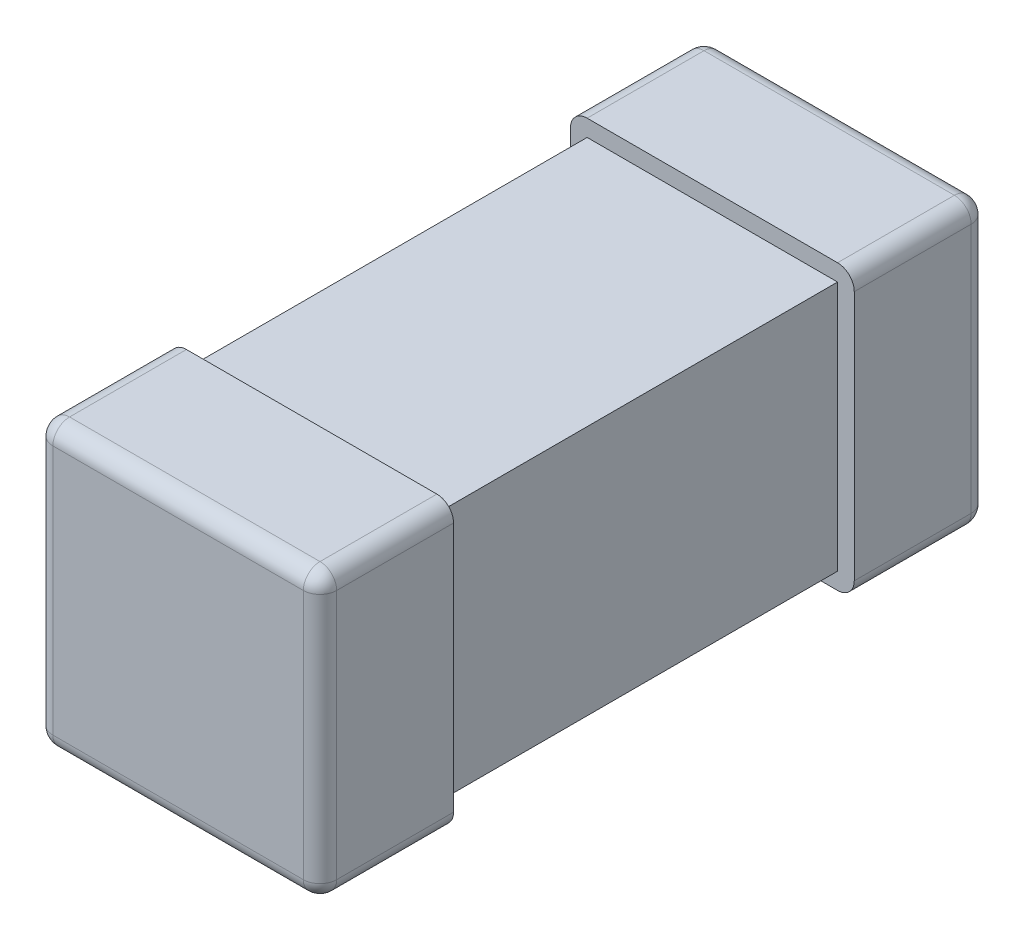
ISO-10303-21;
HEADER;
FILE_DESCRIPTION(('STEP AP214'),'2;1');
FILE_NAME('part.step','',(''),(''),'','','');
FILE_SCHEMA(('AUTOMOTIVE_DESIGN { 1 0 10303 214 1 1 1 1 }'));
ENDSEC;
DATA;
#1=APPLICATION_CONTEXT('core data for automotive mechanical design processes');
#2=APPLICATION_PROTOCOL_DEFINITION('international standard','automotive_design',2000,#1);
#3=PRODUCT_CONTEXT('',#1,'mechanical');
#4=PRODUCT('Part','Part','',(#3));
#5=PRODUCT_RELATED_PRODUCT_CATEGORY('part','',(#4));
#6=PRODUCT_DEFINITION_FORMATION('','',#4);
#7=PRODUCT_DEFINITION_CONTEXT('part definition',#1,'design');
#8=PRODUCT_DEFINITION('design','',#6,#7);
#9=PRODUCT_DEFINITION_SHAPE('','',#8);
#10=(LENGTH_UNIT() NAMED_UNIT(*) SI_UNIT(.MILLI.,.METRE.));
#11=(NAMED_UNIT(*) PLANE_ANGLE_UNIT() SI_UNIT($,.RADIAN.));
#12=(NAMED_UNIT(*) SI_UNIT($,.STERADIAN.) SOLID_ANGLE_UNIT());
#13=UNCERTAINTY_MEASURE_WITH_UNIT(LENGTH_MEASURE(1.E-05),#10,'distance_accuracy_value','');
#14=(GEOMETRIC_REPRESENTATION_CONTEXT(3) GLOBAL_UNCERTAINTY_ASSIGNED_CONTEXT((#13)) GLOBAL_UNIT_ASSIGNED_CONTEXT((#10,
#11,#12)) REPRESENTATION_CONTEXT('',''));
#15=CARTESIAN_POINT('',(0.,0.,0.));
#16=DIRECTION('',(0.,0.,1.));
#17=DIRECTION('',(1.,0.,0.));
#18=AXIS2_PLACEMENT_3D('',#15,#16,#17);
#19=CARTESIAN_POINT('',(-18.9670000000007,2.43166,-7.24620016999998));
#20=DIRECTION('',(0.,0.,-1.));
#21=DIRECTION('',(-1.,0.,0.));
#22=AXIS2_PLACEMENT_3D('',#19,#20,#21);
#23=PLANE('',#22);
#24=DIRECTION('',(0.,1.,0.));
#25=VECTOR('',#24,1.);
#26=CARTESIAN_POINT('',(-18.1670000000007,2.43166,-7.24620016999998));
#27=LINE('',#26,#25);
#28=CARTESIAN_POINT('',(-18.1670000000007,2.38166,-7.24620016999998));
#29=VERTEX_POINT('',#28);
#30=CARTESIAN_POINT('',(-18.1670000000007,1.63166,-7.24620016999998));
#31=VERTEX_POINT('',#30);
#32=EDGE_CURVE('E395',#29,#31,#27,.F.);
#33=ORIENTED_EDGE('',*,*,#32,.F.);
#34=DIRECTION('',(1.,0.,0.));
#35=VECTOR('',#34,1.);
#36=CARTESIAN_POINT('',(-18.9670000000007,2.38166,-7.24620016999998));
#37=LINE('',#36,#35);
#38=CARTESIAN_POINT('',(-18.9170000000007,2.38166,-7.24620016999998));
#39=VERTEX_POINT('',#38);
#40=EDGE_CURVE('E503',#39,#29,#37,.T.);
#41=ORIENTED_EDGE('',*,*,#40,.F.);
#42=DIRECTION('',(0.,-1.,0.));
#43=VECTOR('',#42,1.);
#44=CARTESIAN_POINT('',(-18.9170000000007,1.58166,-7.24620016999998));
#45=LINE('',#44,#43);
#46=CARTESIAN_POINT('',(-18.9170000000007,1.63166,-7.24620016999998));
#47=VERTEX_POINT('',#46);
#48=EDGE_CURVE('E437',#47,#39,#45,.F.);
#49=ORIENTED_EDGE('',*,*,#48,.F.);
#50=DIRECTION('',(1.,0.,0.));
#51=VECTOR('',#50,1.);
#52=CARTESIAN_POINT('',(-18.9670000000007,1.63166,-7.24620016999998));
#53=LINE('',#52,#51);
#54=EDGE_CURVE('E494',#31,#47,#53,.F.);
#55=ORIENTED_EDGE('',*,*,#54,.F.);
#56=EDGE_LOOP('',(#33,#41,#49,#55));
#57=FACE_BOUND('',#56,.T.);
#58=ADVANCED_FACE('F16',(#57),#23,.F.);
#59=CARTESIAN_POINT('',(-18.9670000000007,2.43166,-9.24620016999998));
#60=DIRECTION('',(0.,0.,1.));
#61=DIRECTION('',(1.,0.,0.));
#62=AXIS2_PLACEMENT_3D('',#59,#60,#61);
#63=PLANE('',#62);
#64=DIRECTION('',(0.,1.,0.));
#65=VECTOR('',#64,1.);
#66=CARTESIAN_POINT('',(-18.9170000000007,1.58166,-9.24620016999998));
#67=LINE('',#66,#65);
#68=CARTESIAN_POINT('',(-18.9170000000007,2.38166,-9.24620016999998));
#69=VERTEX_POINT('',#68);
#70=CARTESIAN_POINT('',(-18.9170000000007,1.63166,-9.24620016999998));
#71=VERTEX_POINT('',#70);
#72=EDGE_CURVE('E303',#69,#71,#67,.F.);
#73=ORIENTED_EDGE('',*,*,#72,.F.);
#74=DIRECTION('',(1.,0.,0.));
#75=VECTOR('',#74,1.);
#76=CARTESIAN_POINT('',(-18.9670000000007,2.38166,-9.24620016999998));
#77=LINE('',#76,#75);
#78=CARTESIAN_POINT('',(-18.1670000000007,2.38166,-9.24620016999998));
#79=VERTEX_POINT('',#78);
#80=EDGE_CURVE('E394',#79,#69,#77,.F.);
#81=ORIENTED_EDGE('',*,*,#80,.F.);
#82=DIRECTION('',(0.,-1.,0.));
#83=VECTOR('',#82,1.);
#84=CARTESIAN_POINT('',(-18.1670000000007,2.43166,-9.24620016999998));
#85=LINE('',#84,#83);
#86=CARTESIAN_POINT('',(-18.1670000000007,1.63166,-9.24620016999998));
#87=VERTEX_POINT('',#86);
#88=EDGE_CURVE('E345',#87,#79,#85,.F.);
#89=ORIENTED_EDGE('',*,*,#88,.F.);
#90=DIRECTION('',(1.,0.,0.));
#91=VECTOR('',#90,1.);
#92=CARTESIAN_POINT('',(-18.9670000000007,1.63166,-9.24620016999998));
#93=LINE('',#92,#91);
#94=EDGE_CURVE('E477',#71,#87,#93,.T.);
#95=ORIENTED_EDGE('',*,*,#94,.F.);
#96=EDGE_LOOP('',(#73,#81,#89,#95));
#97=FACE_BOUND('',#96,.T.);
#98=ADVANCED_FACE('F466',(#97),#63,.F.);
#99=CARTESIAN_POINT('',(-18.1670000000007,2.38166,-7.29620016999998));
#100=DIRECTION('',(-1.,0.,0.));
#101=DIRECTION('',(0.,0.,1.));
#102=AXIS2_PLACEMENT_3D('',#99,#100,#101);
#103=SPHERICAL_SURFACE('',#102,0.05);
#104=CARTESIAN_POINT('',(-18.1670000000007,2.38166,-7.29620016999998));
#105=DIRECTION('',(1.,0.,0.));
#106=DIRECTION('',(0.,0.,-1.));
#107=AXIS2_PLACEMENT_3D('',#104,#105,#106);
#108=CIRCLE('',#107,0.05);
#109=CARTESIAN_POINT('',(-18.1670000000007,2.43166,-7.29620016999998));
#110=VERTEX_POINT('',#109);
#111=EDGE_CURVE('E505',#29,#110,#108,.F.);
#112=ORIENTED_EDGE('',*,*,#111,.F.);
#113=CARTESIAN_POINT('',(-18.1670000000007,2.38166,-7.29620016999998));
#114=DIRECTION('',(0.,1.,0.));
#115=DIRECTION('',(-1.,0.,0.));
#116=AXIS2_PLACEMENT_3D('',#113,#114,#115);
#117=CIRCLE('',#116,0.05);
#118=CARTESIAN_POINT('',(-18.1170000000007,2.38166,-7.29620016999998));
#119=VERTEX_POINT('',#118);
#120=EDGE_CURVE('E401',#119,#29,#117,.F.);
#121=ORIENTED_EDGE('',*,*,#120,.F.);
#122=CARTESIAN_POINT('',(-18.1670000000007,2.38166,-7.29620016999998));
#123=DIRECTION('',(0.,0.,-1.));
#124=DIRECTION('',(-1.,0.,0.));
#125=AXIS2_PLACEMENT_3D('',#122,#123,#124);
#126=CIRCLE('',#125,0.05);
#127=EDGE_CURVE('E188',#110,#119,#126,.T.);
#128=ORIENTED_EDGE('',*,*,#127,.F.);
#129=EDGE_LOOP('',(#112,#121,#128));
#130=FACE_BOUND('',#129,.T.);
#131=ADVANCED_FACE('F462',(#130),#103,.T.);
#132=CARTESIAN_POINT('',(-18.9670000000007,2.38166,-7.29620016999998));
#133=DIRECTION('',(1.,0.,0.));
#134=DIRECTION('',(0.,0.,-1.));
#135=AXIS2_PLACEMENT_3D('',#132,#133,#134);
#136=CYLINDRICAL_SURFACE('',#135,0.05);
#137=ORIENTED_EDGE('',*,*,#111,.T.);
#138=DIRECTION('',(1.,0.,0.));
#139=VECTOR('',#138,1.);
#140=CARTESIAN_POINT('',(-18.9670000000007,2.43166,-7.29620016999998));
#141=LINE('',#140,#139);
#142=CARTESIAN_POINT('',(-18.9170000000007,2.43166,-7.29620016999998));
#143=VERTEX_POINT('',#142);
#144=EDGE_CURVE('E186',#110,#143,#141,.F.);
#145=ORIENTED_EDGE('',*,*,#144,.T.);
#146=CARTESIAN_POINT('',(-18.9170000000007,2.38166,-7.29620016999998));
#147=DIRECTION('',(-1.,0.,0.));
#148=DIRECTION('',(0.,0.,1.));
#149=AXIS2_PLACEMENT_3D('',#146,#147,#148);
#150=CIRCLE('',#149,0.0499999999999997);
#151=EDGE_CURVE('E446',#39,#143,#150,.T.);
#152=ORIENTED_EDGE('',*,*,#151,.F.);
#153=ORIENTED_EDGE('',*,*,#40,.T.);
#154=EDGE_LOOP('',(#137,#145,#152,#153));
#155=FACE_BOUND('',#154,.T.);
#156=ADVANCED_FACE('F458',(#155),#136,.T.);
#157=CARTESIAN_POINT('',(-18.9170000000007,2.38166,-7.29620016999998));
#158=DIRECTION('',(-1.,0.,0.));
#159=DIRECTION('',(0.,0.,1.));
#160=AXIS2_PLACEMENT_3D('',#157,#158,#159);
#161=SPHERICAL_SURFACE('',#160,0.05);
#162=CARTESIAN_POINT('',(-18.9170000000007,2.38166,-7.29620016999998));
#163=DIRECTION('',(0.,0.,1.));
#164=DIRECTION('',(1.,0.,0.));
#165=AXIS2_PLACEMENT_3D('',#162,#163,#164);
#166=CIRCLE('',#165,0.05);
#167=CARTESIAN_POINT('',(-18.9670000000007,2.38166,-7.29620016999998));
#168=VERTEX_POINT('',#167);
#169=EDGE_CURVE('E284',#168,#143,#166,.F.);
#170=ORIENTED_EDGE('',*,*,#169,.F.);
#171=CARTESIAN_POINT('',(-18.9170000000007,2.38166,-7.29620016999998));
#172=DIRECTION('',(0.,-1.,0.));
#173=DIRECTION('',(1.,0.,0.));
#174=AXIS2_PLACEMENT_3D('',#171,#172,#173);
#175=CIRCLE('',#174,0.05);
#176=EDGE_CURVE('E444',#39,#168,#175,.T.);
#177=ORIENTED_EDGE('',*,*,#176,.F.);
#178=ORIENTED_EDGE('',*,*,#151,.T.);
#179=EDGE_LOOP('',(#170,#177,#178));
#180=FACE_BOUND('',#179,.T.);
#181=ADVANCED_FACE('F455',(#180),#161,.T.);
#182=CARTESIAN_POINT('',(-18.9170000000007,1.58166,-7.29620016999998));
#183=DIRECTION('',(0.,-1.,0.));
#184=DIRECTION('',(1.,0.,0.));
#185=AXIS2_PLACEMENT_3D('',#182,#183,#184);
#186=CYLINDRICAL_SURFACE('',#185,0.05);
#187=CARTESIAN_POINT('',(-18.9170000000007,1.63166,-7.29620016999998));
#188=DIRECTION('',(0.,1.,0.));
#189=DIRECTION('',(-1.,0.,0.));
#190=AXIS2_PLACEMENT_3D('',#187,#188,#189);
#191=CIRCLE('',#190,0.05);
#192=CARTESIAN_POINT('',(-18.9670000000007,1.63166,-7.29620016999998));
#193=VERTEX_POINT('',#192);
#194=EDGE_CURVE('E434',#47,#193,#191,.F.);
#195=ORIENTED_EDGE('',*,*,#194,.F.);
#196=ORIENTED_EDGE('',*,*,#48,.T.);
#197=ORIENTED_EDGE('',*,*,#176,.T.);
#198=DIRECTION('',(0.,1.,0.));
#199=VECTOR('',#198,1.);
#200=CARTESIAN_POINT('',(-18.9670000000007,1.58166,-7.29620016999998));
#201=LINE('',#200,#199);
#202=EDGE_CURVE('E279',#193,#168,#201,.T.);
#203=ORIENTED_EDGE('',*,*,#202,.F.);
#204=EDGE_LOOP('',(#195,#196,#197,#203));
#205=FACE_BOUND('',#204,.T.);
#206=ADVANCED_FACE('F426',(#205),#186,.T.);
#207=CARTESIAN_POINT('',(-18.9170000000007,1.63166,-7.29620016999998));
#208=DIRECTION('',(-1.,0.,0.));
#209=DIRECTION('',(0.,0.,1.));
#210=AXIS2_PLACEMENT_3D('',#207,#208,#209);
#211=SPHERICAL_SURFACE('',#210,0.05);
#212=CARTESIAN_POINT('',(-18.9170000000007,1.63166,-7.29620016999998));
#213=DIRECTION('',(0.,0.,-1.));
#214=DIRECTION('',(-1.,0.,0.));
#215=AXIS2_PLACEMENT_3D('',#212,#213,#214);
#216=CIRCLE('',#215,0.05);
#217=CARTESIAN_POINT('',(-18.9170000000007,1.58166,-7.29620016999998));
#218=VERTEX_POINT('',#217);
#219=EDGE_CURVE('E274',#218,#193,#216,.T.);
#220=ORIENTED_EDGE('',*,*,#219,.F.);
#221=CARTESIAN_POINT('',(-18.9170000000007,1.63166,-7.29620016999998));
#222=DIRECTION('',(1.,0.,0.));
#223=DIRECTION('',(0.,0.,-1.));
#224=AXIS2_PLACEMENT_3D('',#221,#222,#223);
#225=CIRCLE('',#224,0.05);
#226=EDGE_CURVE('E436',#47,#218,#225,.T.);
#227=ORIENTED_EDGE('',*,*,#226,.F.);
#228=ORIENTED_EDGE('',*,*,#194,.T.);
#229=EDGE_LOOP('',(#220,#227,#228));
#230=FACE_BOUND('',#229,.T.);
#231=ADVANCED_FACE('F421',(#230),#211,.T.);
#232=CARTESIAN_POINT('',(-18.9670000000007,1.63166,-7.29620016999998));
#233=DIRECTION('',(1.,0.,0.));
#234=DIRECTION('',(0.,0.,-1.));
#235=AXIS2_PLACEMENT_3D('',#232,#233,#234);
#236=CYLINDRICAL_SURFACE('',#235,0.05);
#237=CARTESIAN_POINT('',(-18.1670000000007,1.63166,-7.29620016999998));
#238=DIRECTION('',(-1.,0.,0.));
#239=DIRECTION('',(0.,0.,1.));
#240=AXIS2_PLACEMENT_3D('',#237,#238,#239);
#241=CIRCLE('',#240,0.0499999999999997);
#242=CARTESIAN_POINT('',(-18.1670000000007,1.58166,-7.29620016999998));
#243=VERTEX_POINT('',#242);
#244=EDGE_CURVE('E404',#31,#243,#241,.F.);
#245=ORIENTED_EDGE('',*,*,#244,.F.);
#246=ORIENTED_EDGE('',*,*,#54,.T.);
#247=ORIENTED_EDGE('',*,*,#226,.T.);
#248=DIRECTION('',(-1.,0.,0.));
#249=VECTOR('',#248,1.);
#250=CARTESIAN_POINT('',(-18.9670000000007,1.58166,-7.29620016999998));
#251=LINE('',#250,#249);
#252=EDGE_CURVE('E269',#218,#243,#251,.F.);
#253=ORIENTED_EDGE('',*,*,#252,.T.);
#254=EDGE_LOOP('',(#245,#246,#247,#253));
#255=FACE_BOUND('',#254,.T.);
#256=ADVANCED_FACE('F417',(#255),#236,.T.);
#257=CARTESIAN_POINT('',(-18.1670000000007,1.63166,-7.29620016999998));
#258=DIRECTION('',(-1.,0.,0.));
#259=DIRECTION('',(0.,0.,1.));
#260=AXIS2_PLACEMENT_3D('',#257,#258,#259);
#261=SPHERICAL_SURFACE('',#260,0.05);
#262=ORIENTED_EDGE('',*,*,#244,.T.);
#263=CARTESIAN_POINT('',(-18.1670000000007,1.63166,-7.29620016999998));
#264=DIRECTION('',(0.,0.,1.));
#265=DIRECTION('',(1.,0.,0.));
#266=AXIS2_PLACEMENT_3D('',#263,#264,#265);
#267=CIRCLE('',#266,0.05);
#268=CARTESIAN_POINT('',(-18.1170000000007,1.63166,-7.29620016999998));
#269=VERTEX_POINT('',#268);
#270=EDGE_CURVE('E263',#269,#243,#267,.F.);
#271=ORIENTED_EDGE('',*,*,#270,.F.);
#272=CARTESIAN_POINT('',(-18.1670000000007,1.63166,-7.29620016999998));
#273=DIRECTION('',(0.,1.,0.));
#274=DIRECTION('',(-1.,0.,0.));
#275=AXIS2_PLACEMENT_3D('',#272,#273,#274);
#276=CIRCLE('',#275,0.05);
#277=EDGE_CURVE('E392',#31,#269,#276,.T.);
#278=ORIENTED_EDGE('',*,*,#277,.F.);
#279=EDGE_LOOP('',(#262,#271,#278));
#280=FACE_BOUND('',#279,.T.);
#281=ADVANCED_FACE('F414',(#280),#261,.T.);
#282=CARTESIAN_POINT('',(-18.1670000000007,2.43166,-7.29620016999998));
#283=DIRECTION('',(0.,1.,0.));
#284=DIRECTION('',(-1.,0.,0.));
#285=AXIS2_PLACEMENT_3D('',#282,#283,#284);
#286=CYLINDRICAL_SURFACE('',#285,0.05);
#287=ORIENTED_EDGE('',*,*,#277,.T.);
#288=DIRECTION('',(0.,1.,0.));
#289=VECTOR('',#288,1.);
#290=CARTESIAN_POINT('',(-18.1170000000007,1.58166,-7.29620016999998));
#291=LINE('',#290,#289);
#292=EDGE_CURVE('E255',#269,#119,#291,.T.);
#293=ORIENTED_EDGE('',*,*,#292,.T.);
#294=ORIENTED_EDGE('',*,*,#120,.T.);
#295=ORIENTED_EDGE('',*,*,#32,.T.);
#296=EDGE_LOOP('',(#287,#293,#294,#295));
#297=FACE_BOUND('',#296,.T.);
#298=ADVANCED_FACE('F376',(#297),#286,.T.);
#299=CARTESIAN_POINT('',(-18.9170000000007,2.38166,-9.19620016999998));
#300=DIRECTION('',(-1.,0.,0.));
#301=DIRECTION('',(0.,0.,1.));
#302=AXIS2_PLACEMENT_3D('',#299,#300,#301);
#303=SPHERICAL_SURFACE('',#302,0.05);
#304=CARTESIAN_POINT('',(-18.9170000000007,2.38166,-9.19620016999998));
#305=DIRECTION('',(1.,0.,0.));
#306=DIRECTION('',(0.,0.,-1.));
#307=AXIS2_PLACEMENT_3D('',#304,#305,#306);
#308=CIRCLE('',#307,0.05);
#309=CARTESIAN_POINT('',(-18.9170000000007,2.43166,-9.19620016999998));
#310=VERTEX_POINT('',#309);
#311=EDGE_CURVE('E487',#69,#310,#308,.T.);
#312=ORIENTED_EDGE('',*,*,#311,.F.);
#313=CARTESIAN_POINT('',(-18.9170000000007,2.38166,-9.19620016999998));
#314=DIRECTION('',(0.,1.,0.));
#315=DIRECTION('',(-1.,0.,0.));
#316=AXIS2_PLACEMENT_3D('',#313,#314,#315);
#317=CIRCLE('',#316,0.05);
#318=CARTESIAN_POINT('',(-18.9670000000007,2.38166,-9.19620016999998));
#319=VERTEX_POINT('',#318);
#320=EDGE_CURVE('E300',#319,#69,#317,.F.);
#321=ORIENTED_EDGE('',*,*,#320,.F.);
#322=CARTESIAN_POINT('',(-18.9170000000007,2.38166,-9.19620016999998));
#323=DIRECTION('',(0.,0.,1.));
#324=DIRECTION('',(1.,0.,0.));
#325=AXIS2_PLACEMENT_3D('',#322,#323,#324);
#326=CIRCLE('',#325,0.05);
#327=EDGE_CURVE('E249',#310,#319,#326,.T.);
#328=ORIENTED_EDGE('',*,*,#327,.F.);
#329=EDGE_LOOP('',(#312,#321,#328));
#330=FACE_BOUND('',#329,.T.);
#331=ADVANCED_FACE('F371',(#330),#303,.T.);
#332=CARTESIAN_POINT('',(-18.9670000000007,2.38166,-9.19620016999998));
#333=DIRECTION('',(1.,0.,0.));
#334=DIRECTION('',(0.,0.,-1.));
#335=AXIS2_PLACEMENT_3D('',#332,#333,#334);
#336=CYLINDRICAL_SURFACE('',#335,0.05);
#337=ORIENTED_EDGE('',*,*,#311,.T.);
#338=DIRECTION('',(1.,0.,0.));
#339=VECTOR('',#338,1.);
#340=CARTESIAN_POINT('',(-18.9670000000007,2.43166,-9.19620016999998));
#341=LINE('',#340,#339);
#342=CARTESIAN_POINT('',(-18.1670000000007,2.43166,-9.19620016999998));
#343=VERTEX_POINT('',#342);
#344=EDGE_CURVE('E248',#310,#343,#341,.T.);
#345=ORIENTED_EDGE('',*,*,#344,.T.);
#346=CARTESIAN_POINT('',(-18.1670000000007,2.38166,-9.19620016999998));
#347=DIRECTION('',(-1.,0.,0.));
#348=DIRECTION('',(0.,0.,1.));
#349=AXIS2_PLACEMENT_3D('',#346,#347,#348);
#350=CIRCLE('',#349,0.0499999999999997);
#351=EDGE_CURVE('E350',#79,#343,#350,.F.);
#352=ORIENTED_EDGE('',*,*,#351,.F.);
#353=ORIENTED_EDGE('',*,*,#80,.T.);
#354=EDGE_LOOP('',(#337,#345,#352,#353));
#355=FACE_BOUND('',#354,.T.);
#356=ADVANCED_FACE('F367',(#355),#336,.T.);
#357=CARTESIAN_POINT('',(-18.1670000000007,2.38166,-9.19620016999998));
#358=DIRECTION('',(-1.,0.,0.));
#359=DIRECTION('',(0.,0.,1.));
#360=AXIS2_PLACEMENT_3D('',#357,#358,#359);
#361=SPHERICAL_SURFACE('',#360,0.05);
#362=CARTESIAN_POINT('',(-18.1670000000007,2.38166,-9.19620016999998));
#363=DIRECTION('',(0.,-1.,0.));
#364=DIRECTION('',(1.,0.,0.));
#365=AXIS2_PLACEMENT_3D('',#362,#363,#364);
#366=CIRCLE('',#365,0.05);
#367=CARTESIAN_POINT('',(-18.1170000000007,2.38166,-9.19620016999998));
#368=VERTEX_POINT('',#367);
#369=EDGE_CURVE('E348',#79,#368,#366,.T.);
#370=ORIENTED_EDGE('',*,*,#369,.F.);
#371=ORIENTED_EDGE('',*,*,#351,.T.);
#372=CARTESIAN_POINT('',(-18.1670000000007,2.38166,-9.19620016999998));
#373=DIRECTION('',(0.,0.,-1.));
#374=DIRECTION('',(-1.,0.,0.));
#375=AXIS2_PLACEMENT_3D('',#372,#373,#374);
#376=CIRCLE('',#375,0.05);
#377=EDGE_CURVE('E242',#368,#343,#376,.F.);
#378=ORIENTED_EDGE('',*,*,#377,.F.);
#379=EDGE_LOOP('',(#370,#371,#378));
#380=FACE_BOUND('',#379,.T.);
#381=ADVANCED_FACE('F364',(#380),#361,.T.);
#382=CARTESIAN_POINT('',(-18.1670000000007,2.43166,-9.19620016999998));
#383=DIRECTION('',(0.,-1.,0.));
#384=DIRECTION('',(1.,0.,0.));
#385=AXIS2_PLACEMENT_3D('',#382,#383,#384);
#386=CYLINDRICAL_SURFACE('',#385,0.05);
#387=CARTESIAN_POINT('',(-18.1670000000007,1.63166,-9.19620016999998));
#388=DIRECTION('',(0.,-1.,0.));
#389=DIRECTION('',(-1.,0.,0.));
#390=AXIS2_PLACEMENT_3D('',#387,#388,#389);
#391=CIRCLE('',#390,0.05);
#392=CARTESIAN_POINT('',(-18.1170000000007,1.63166,-9.19620016999998));
#393=VERTEX_POINT('',#392);
#394=EDGE_CURVE('E342',#87,#393,#391,.T.);
#395=ORIENTED_EDGE('',*,*,#394,.F.);
#396=ORIENTED_EDGE('',*,*,#88,.T.);
#397=ORIENTED_EDGE('',*,*,#369,.T.);
#398=DIRECTION('',(0.,1.,0.));
#399=VECTOR('',#398,1.);
#400=CARTESIAN_POINT('',(-18.1170000000007,1.58166,-9.19620016999998));
#401=LINE('',#400,#399);
#402=EDGE_CURVE('E237',#368,#393,#401,.F.);
#403=ORIENTED_EDGE('',*,*,#402,.T.);
#404=EDGE_LOOP('',(#395,#396,#397,#403));
#405=FACE_BOUND('',#404,.T.);
#406=ADVANCED_FACE('F334',(#405),#386,.T.);
#407=CARTESIAN_POINT('',(-18.1670000000007,1.63166,-9.19620016999998));
#408=DIRECTION('',(-1.,0.,0.));
#409=DIRECTION('',(0.,0.,1.));
#410=AXIS2_PLACEMENT_3D('',#407,#408,#409);
#411=SPHERICAL_SURFACE('',#410,0.05);
#412=CARTESIAN_POINT('',(-18.1670000000007,1.63166,-9.19620016999998));
#413=DIRECTION('',(0.,0.,1.));
#414=DIRECTION('',(1.,0.,0.));
#415=AXIS2_PLACEMENT_3D('',#412,#413,#414);
#416=CIRCLE('',#415,0.05);
#417=CARTESIAN_POINT('',(-18.1670000000007,1.58166,-9.19620016999998));
#418=VERTEX_POINT('',#417);
#419=EDGE_CURVE('E231',#418,#393,#416,.T.);
#420=ORIENTED_EDGE('',*,*,#419,.F.);
#421=CARTESIAN_POINT('',(-18.1670000000007,1.63166,-9.19620016999998));
#422=DIRECTION('',(1.,0.,0.));
#423=DIRECTION('',(0.,0.,-1.));
#424=AXIS2_PLACEMENT_3D('',#421,#422,#423);
#425=CIRCLE('',#424,0.05);
#426=EDGE_CURVE('E344',#87,#418,#425,.F.);
#427=ORIENTED_EDGE('',*,*,#426,.F.);
#428=ORIENTED_EDGE('',*,*,#394,.T.);
#429=EDGE_LOOP('',(#420,#427,#428));
#430=FACE_BOUND('',#429,.T.);
#431=ADVANCED_FACE('F329',(#430),#411,.T.);
#432=CARTESIAN_POINT('',(-18.9670000000007,1.63166,-9.19620016999998));
#433=DIRECTION('',(1.,0.,0.));
#434=DIRECTION('',(0.,0.,-1.));
#435=AXIS2_PLACEMENT_3D('',#432,#433,#434);
#436=CYLINDRICAL_SURFACE('',#435,0.05);
#437=CARTESIAN_POINT('',(-18.9170000000007,1.63166,-9.19620016999998));
#438=DIRECTION('',(-1.,0.,0.));
#439=DIRECTION('',(0.,0.,1.));
#440=AXIS2_PLACEMENT_3D('',#437,#438,#439);
#441=CIRCLE('',#440,0.0499999999999997);
#442=CARTESIAN_POINT('',(-18.9170000000007,1.58166,-9.19620016999998));
#443=VERTEX_POINT('',#442);
#444=EDGE_CURVE('E304',#71,#443,#441,.T.);
#445=ORIENTED_EDGE('',*,*,#444,.F.);
#446=ORIENTED_EDGE('',*,*,#94,.T.);
#447=ORIENTED_EDGE('',*,*,#426,.T.);
#448=DIRECTION('',(-1.,0.,0.));
#449=VECTOR('',#448,1.);
#450=CARTESIAN_POINT('',(-18.9670000000007,1.58166,-9.19620016999998));
#451=LINE('',#450,#449);
#452=EDGE_CURVE('E226',#418,#443,#451,.T.);
#453=ORIENTED_EDGE('',*,*,#452,.T.);
#454=EDGE_LOOP('',(#445,#446,#447,#453));
#455=FACE_BOUND('',#454,.T.);
#456=ADVANCED_FACE('F324',(#455),#436,.T.);
#457=CARTESIAN_POINT('',(-18.9170000000007,1.63166,-9.19620016999998));
#458=DIRECTION('',(-1.,0.,0.));
#459=DIRECTION('',(0.,0.,1.));
#460=AXIS2_PLACEMENT_3D('',#457,#458,#459);
#461=SPHERICAL_SURFACE('',#460,0.05);
#462=CARTESIAN_POINT('',(-18.9170000000007,1.63166,-9.19620016999998));
#463=DIRECTION('',(0.,0.,-1.));
#464=DIRECTION('',(-1.,0.,0.));
#465=AXIS2_PLACEMENT_3D('',#462,#463,#464);
#466=CIRCLE('',#465,0.05);
#467=CARTESIAN_POINT('',(-18.9670000000007,1.63166,-9.19620016999998));
#468=VERTEX_POINT('',#467);
#469=EDGE_CURVE('E220',#468,#443,#466,.F.);
#470=ORIENTED_EDGE('',*,*,#469,.F.);
#471=CARTESIAN_POINT('',(-18.9170000000007,1.63166,-9.19620016999998));
#472=DIRECTION('',(0.,1.,0.));
#473=DIRECTION('',(-1.,0.,0.));
#474=AXIS2_PLACEMENT_3D('',#471,#472,#473);
#475=CIRCLE('',#474,0.05);
#476=EDGE_CURVE('E307',#71,#468,#475,.T.);
#477=ORIENTED_EDGE('',*,*,#476,.F.);
#478=ORIENTED_EDGE('',*,*,#444,.T.);
#479=EDGE_LOOP('',(#470,#477,#478));
#480=FACE_BOUND('',#479,.T.);
#481=ADVANCED_FACE('F319',(#480),#461,.T.);
#482=CARTESIAN_POINT('',(-18.9170000000007,1.58166,-9.19620016999998));
#483=DIRECTION('',(0.,1.,0.));
#484=DIRECTION('',(-1.,0.,0.));
#485=AXIS2_PLACEMENT_3D('',#482,#483,#484);
#486=CYLINDRICAL_SURFACE('',#485,0.05);
#487=ORIENTED_EDGE('',*,*,#476,.T.);
#488=DIRECTION('',(0.,1.,0.));
#489=VECTOR('',#488,1.);
#490=CARTESIAN_POINT('',(-18.9670000000007,1.58166,-9.19620016999998));
#491=LINE('',#490,#489);
#492=EDGE_CURVE('E213',#319,#468,#491,.F.);
#493=ORIENTED_EDGE('',*,*,#492,.F.);
#494=ORIENTED_EDGE('',*,*,#320,.T.);
#495=ORIENTED_EDGE('',*,*,#72,.T.);
#496=EDGE_LOOP('',(#487,#493,#494,#495));
#497=FACE_BOUND('',#496,.T.);
#498=ADVANCED_FACE('F323',(#497),#486,.T.);
#499=CARTESIAN_POINT('',(-18.1670000000007,2.38166,-7.64620016999998));
#500=DIRECTION('',(0.,0.,-1.));
#501=DIRECTION('',(-1.,0.,0.));
#502=AXIS2_PLACEMENT_3D('',#499,#500,#501);
#503=CYLINDRICAL_SURFACE('',#502,0.05);
#504=ORIENTED_EDGE('',*,*,#127,.T.);
#505=DIRECTION('',(0.,0.,1.));
#506=VECTOR('',#505,1.);
#507=CARTESIAN_POINT('',(-18.1170000000007,2.38166,-7.64620016999998));
#508=LINE('',#507,#506);
#509=CARTESIAN_POINT('',(-18.1170000000007,2.38166,-7.64620016999998));
#510=VERTEX_POINT('',#509);
#511=EDGE_CURVE('E199',#119,#510,#508,.F.);
#512=ORIENTED_EDGE('',*,*,#511,.T.);
#513=CARTESIAN_POINT('',(-18.1670000000007,2.38166,-7.64620016999998));
#514=DIRECTION('',(0.,0.,-1.));
#515=DIRECTION('',(-1.,0.,0.));
#516=AXIS2_PLACEMENT_3D('',#513,#514,#515);
#517=CIRCLE('',#516,0.05);
#518=CARTESIAN_POINT('',(-18.1670000000007,2.43166,-7.64620016999998));
#519=VERTEX_POINT('',#518);
#520=EDGE_CURVE('E19',#510,#519,#517,.F.);
#521=ORIENTED_EDGE('',*,*,#520,.T.);
#522=DIRECTION('',(0.,0.,1.));
#523=VECTOR('',#522,1.);
#524=CARTESIAN_POINT('',(-18.1670000000007,2.43166,-7.64620016999998));
#525=LINE('',#524,#523);
#526=EDGE_CURVE('E181',#519,#110,#525,.T.);
#527=ORIENTED_EDGE('',*,*,#526,.T.);
#528=EDGE_LOOP('',(#504,#512,#521,#527));
#529=FACE_BOUND('',#528,.T.);
#530=ADVANCED_FACE('F197',(#529),#503,.T.);
#531=CARTESIAN_POINT('',(-18.9670000000007,2.43166,-7.64620016999998));
#532=DIRECTION('',(0.,-1.,0.));
#533=DIRECTION('',(1.,0.,0.));
#534=AXIS2_PLACEMENT_3D('',#531,#532,#533);
#535=PLANE('',#534);
#536=ORIENTED_EDGE('',*,*,#526,.F.);
#537=DIRECTION('',(1.,0.,0.));
#538=VECTOR('',#537,1.);
#539=CARTESIAN_POINT('',(-18.9670000000007,2.43166,-7.64620016999998));
#540=LINE('',#539,#538);
#541=CARTESIAN_POINT('',(-18.9170000000007,2.43166,-7.64620016999998));
#542=VERTEX_POINT('',#541);
#543=EDGE_CURVE('E184',#519,#542,#540,.F.);
#544=ORIENTED_EDGE('',*,*,#543,.T.);
#545=DIRECTION('',(0.,0.,1.));
#546=VECTOR('',#545,1.);
#547=CARTESIAN_POINT('',(-18.9170000000007,2.43166,-7.64620016999998));
#548=LINE('',#547,#546);
#549=EDGE_CURVE('E282',#143,#542,#548,.F.);
#550=ORIENTED_EDGE('',*,*,#549,.F.);
#551=ORIENTED_EDGE('',*,*,#144,.F.);
#552=EDGE_LOOP('',(#536,#544,#550,#551));
#553=FACE_BOUND('',#552,.T.);
#554=ADVANCED_FACE('F182',(#553),#535,.F.);
#555=CARTESIAN_POINT('',(-18.9170000000007,2.38166,-7.64620016999998));
#556=DIRECTION('',(0.,0.,1.));
#557=DIRECTION('',(1.,0.,0.));
#558=AXIS2_PLACEMENT_3D('',#555,#556,#557);
#559=CYLINDRICAL_SURFACE('',#558,0.05);
#560=CARTESIAN_POINT('',(-18.9170000000007,2.38166,-7.64620016999998));
#561=DIRECTION('',(0.,0.,1.));
#562=DIRECTION('',(1.,0.,0.));
#563=AXIS2_PLACEMENT_3D('',#560,#561,#562);
#564=CIRCLE('',#563,0.05);
#565=CARTESIAN_POINT('',(-18.9670000000007,2.38166,-7.64620016999998));
#566=VERTEX_POINT('',#565);
#567=EDGE_CURVE('E195',#542,#566,#564,.T.);
#568=ORIENTED_EDGE('',*,*,#567,.T.);
#569=DIRECTION('',(0.,0.,1.));
#570=VECTOR('',#569,1.);
#571=CARTESIAN_POINT('',(-18.9670000000007,2.38166,-7.64620016999998));
#572=LINE('',#571,#570);
#573=EDGE_CURVE('E277',#168,#566,#572,.F.);
#574=ORIENTED_EDGE('',*,*,#573,.F.);
#575=ORIENTED_EDGE('',*,*,#169,.T.);
#576=ORIENTED_EDGE('',*,*,#549,.T.);
#577=EDGE_LOOP('',(#568,#574,#575,#576));
#578=FACE_BOUND('',#577,.T.);
#579=ADVANCED_FACE('F700',(#578),#559,.T.);
#580=CARTESIAN_POINT('',(-18.9670000000007,1.58166,-7.64620016999998));
#581=DIRECTION('',(-1.,0.,0.));
#582=DIRECTION('',(0.,0.,1.));
#583=AXIS2_PLACEMENT_3D('',#580,#581,#582);
#584=PLANE('',#583);
#585=ORIENTED_EDGE('',*,*,#202,.T.);
#586=ORIENTED_EDGE('',*,*,#573,.T.);
#587=DIRECTION('',(0.,1.,0.));
#588=VECTOR('',#587,1.);
#589=CARTESIAN_POINT('',(-18.9670000000007,2.43166,-7.64620016999998));
#590=LINE('',#589,#588);
#591=CARTESIAN_POINT('',(-18.9670000000007,1.63166,-7.64620016999998));
#592=VERTEX_POINT('',#591);
#593=EDGE_CURVE('E532',#566,#592,#590,.F.);
#594=ORIENTED_EDGE('',*,*,#593,.T.);
#595=DIRECTION('',(0.,0.,-1.));
#596=VECTOR('',#595,1.);
#597=CARTESIAN_POINT('',(-18.9670000000007,1.63166,-7.64620016999998));
#598=LINE('',#597,#596);
#599=EDGE_CURVE('E270',#193,#592,#598,.T.);
#600=ORIENTED_EDGE('',*,*,#599,.F.);
#601=EDGE_LOOP('',(#585,#586,#594,#600));
#602=FACE_BOUND('',#601,.T.);
#603=ADVANCED_FACE('F696',(#602),#584,.T.);
#604=CARTESIAN_POINT('',(-18.9170000000007,1.63166,-7.64620016999998));
#605=DIRECTION('',(0.,0.,-1.));
#606=DIRECTION('',(-1.,0.,0.));
#607=AXIS2_PLACEMENT_3D('',#604,#605,#606);
#608=CYLINDRICAL_SURFACE('',#607,0.05);
#609=ORIENTED_EDGE('',*,*,#219,.T.);
#610=ORIENTED_EDGE('',*,*,#599,.T.);
#611=CARTESIAN_POINT('',(-18.9170000000007,1.63166,-7.64620016999998));
#612=DIRECTION('',(0.,0.,-1.));
#613=DIRECTION('',(-1.,0.,0.));
#614=AXIS2_PLACEMENT_3D('',#611,#612,#613);
#615=CIRCLE('',#614,0.05);
#616=CARTESIAN_POINT('',(-18.9170000000007,1.58166,-7.64620016999998));
#617=VERTEX_POINT('',#616);
#618=EDGE_CURVE('E530',#592,#617,#615,.F.);
#619=ORIENTED_EDGE('',*,*,#618,.T.);
#620=DIRECTION('',(0.,0.,1.));
#621=VECTOR('',#620,1.);
#622=CARTESIAN_POINT('',(-18.9170000000007,1.58166,-7.64620016999998));
#623=LINE('',#622,#621);
#624=EDGE_CURVE('E266',#617,#218,#623,.T.);
#625=ORIENTED_EDGE('',*,*,#624,.T.);
#626=EDGE_LOOP('',(#609,#610,#619,#625));
#627=FACE_BOUND('',#626,.T.);
#628=ADVANCED_FACE('F692',(#627),#608,.T.);
#629=CARTESIAN_POINT('',(-18.9670000000007,1.58166,-7.64620016999998));
#630=DIRECTION('',(0.,1.,0.));
#631=DIRECTION('',(-1.,0.,0.));
#632=AXIS2_PLACEMENT_3D('',#629,#630,#631);
#633=PLANE('',#632);
#634=DIRECTION('',(0.,0.,1.));
#635=VECTOR('',#634,1.);
#636=CARTESIAN_POINT('',(-18.1670000000007,1.58166,-7.64620016999998));
#637=LINE('',#636,#635);
#638=CARTESIAN_POINT('',(-18.1670000000007,1.58166,-7.64620016999998));
#639=VERTEX_POINT('',#638);
#640=EDGE_CURVE('E259',#243,#639,#637,.F.);
#641=ORIENTED_EDGE('',*,*,#640,.F.);
#642=ORIENTED_EDGE('',*,*,#252,.F.);
#643=ORIENTED_EDGE('',*,*,#624,.F.);
#644=DIRECTION('',(1.,0.,0.));
#645=VECTOR('',#644,1.);
#646=CARTESIAN_POINT('',(-18.9670000000007,1.58166,-7.64620016999998));
#647=LINE('',#646,#645);
#648=EDGE_CURVE('E529',#617,#639,#647,.T.);
#649=ORIENTED_EDGE('',*,*,#648,.T.);
#650=EDGE_LOOP('',(#641,#642,#643,#649));
#651=FACE_BOUND('',#650,.T.);
#652=ADVANCED_FACE('F688',(#651),#633,.F.);
#653=CARTESIAN_POINT('',(-18.1670000000007,1.63166,-7.64620016999998));
#654=DIRECTION('',(0.,0.,1.));
#655=DIRECTION('',(1.,0.,0.));
#656=AXIS2_PLACEMENT_3D('',#653,#654,#655);
#657=CYLINDRICAL_SURFACE('',#656,0.05);
#658=ORIENTED_EDGE('',*,*,#270,.T.);
#659=ORIENTED_EDGE('',*,*,#640,.T.);
#660=CARTESIAN_POINT('',(-18.1670000000007,1.63166,-7.64620016999998));
#661=DIRECTION('',(0.,0.,1.));
#662=DIRECTION('',(1.,0.,0.));
#663=AXIS2_PLACEMENT_3D('',#660,#661,#662);
#664=CIRCLE('',#663,0.05);
#665=CARTESIAN_POINT('',(-18.1170000000007,1.63166,-7.64620016999998));
#666=VERTEX_POINT('',#665);
#667=EDGE_CURVE('E525',#639,#666,#664,.T.);
#668=ORIENTED_EDGE('',*,*,#667,.T.);
#669=DIRECTION('',(0.,0.,1.));
#670=VECTOR('',#669,1.);
#671=CARTESIAN_POINT('',(-18.1170000000007,1.63166,-7.64620016999998));
#672=LINE('',#671,#670);
#673=EDGE_CURVE('E252',#666,#269,#672,.T.);
#674=ORIENTED_EDGE('',*,*,#673,.T.);
#675=EDGE_LOOP('',(#658,#659,#668,#674));
#676=FACE_BOUND('',#675,.T.);
#677=ADVANCED_FACE('F684',(#676),#657,.T.);
#678=CARTESIAN_POINT('',(-18.1170000000007,1.58166,-7.64620016999998));
#679=DIRECTION('',(-1.,0.,0.));
#680=DIRECTION('',(0.,0.,1.));
#681=AXIS2_PLACEMENT_3D('',#678,#679,#680);
#682=PLANE('',#681);
#683=ORIENTED_EDGE('',*,*,#673,.F.);
#684=DIRECTION('',(0.,1.,0.));
#685=VECTOR('',#684,1.);
#686=CARTESIAN_POINT('',(-18.1170000000007,2.43166,-7.64620016999998));
#687=LINE('',#686,#685);
#688=EDGE_CURVE('E528',#666,#510,#687,.T.);
#689=ORIENTED_EDGE('',*,*,#688,.T.);
#690=ORIENTED_EDGE('',*,*,#511,.F.);
#691=ORIENTED_EDGE('',*,*,#292,.F.);
#692=EDGE_LOOP('',(#683,#689,#690,#691));
#693=FACE_BOUND('',#692,.T.);
#694=ADVANCED_FACE('F681',(#693),#682,.F.);
#695=CARTESIAN_POINT('',(-18.9170000000007,2.38166,-9.24620016999998));
#696=DIRECTION('',(0.,0.,1.));
#697=DIRECTION('',(1.,0.,0.));
#698=AXIS2_PLACEMENT_3D('',#695,#696,#697);
#699=CYLINDRICAL_SURFACE('',#698,0.05);
#700=ORIENTED_EDGE('',*,*,#327,.T.);
#701=DIRECTION('',(0.,0.,1.));
#702=VECTOR('',#701,1.);
#703=CARTESIAN_POINT('',(-18.9670000000007,2.38166,-9.24620016999998));
#704=LINE('',#703,#702);
#705=CARTESIAN_POINT('',(-18.9670000000007,2.38166,-8.84620016999998));
#706=VERTEX_POINT('',#705);
#707=EDGE_CURVE('E202',#706,#319,#704,.F.);
#708=ORIENTED_EDGE('',*,*,#707,.F.);
#709=CARTESIAN_POINT('',(-18.9170000000007,2.38166,-8.84620016999998));
#710=DIRECTION('',(0.,0.,1.));
#711=DIRECTION('',(1.,0.,0.));
#712=AXIS2_PLACEMENT_3D('',#709,#710,#711);
#713=CIRCLE('',#712,0.05);
#714=CARTESIAN_POINT('',(-18.9170000000007,2.43166,-8.84620016999998));
#715=VERTEX_POINT('',#714);
#716=EDGE_CURVE('E521',#706,#715,#713,.F.);
#717=ORIENTED_EDGE('',*,*,#716,.T.);
#718=DIRECTION('',(0.,0.,1.));
#719=VECTOR('',#718,1.);
#720=CARTESIAN_POINT('',(-18.9170000000007,2.43166,-9.24620016999998));
#721=LINE('',#720,#719);
#722=EDGE_CURVE('E245',#715,#310,#721,.F.);
#723=ORIENTED_EDGE('',*,*,#722,.T.);
#724=EDGE_LOOP('',(#700,#708,#717,#723));
#725=FACE_BOUND('',#724,.T.);
#726=ADVANCED_FACE('F617',(#725),#699,.T.);
#727=CARTESIAN_POINT('',(-18.9670000000007,2.43166,-9.24620016999998));
#728=DIRECTION('',(0.,-1.,0.));
#729=DIRECTION('',(1.,0.,0.));
#730=AXIS2_PLACEMENT_3D('',#727,#728,#729);
#731=PLANE('',#730);
#732=ORIENTED_EDGE('',*,*,#722,.F.);
#733=DIRECTION('',(-1.,0.,0.));
#734=VECTOR('',#733,1.);
#735=CARTESIAN_POINT('',(-18.9670000000007,2.43166,-8.84620016999998));
#736=LINE('',#735,#734);
#737=CARTESIAN_POINT('',(-18.1670000000007,2.43166,-8.84620016999998));
#738=VERTEX_POINT('',#737);
#739=EDGE_CURVE('E520',#715,#738,#736,.F.);
#740=ORIENTED_EDGE('',*,*,#739,.T.);
#741=DIRECTION('',(0.,0.,-1.));
#742=VECTOR('',#741,1.);
#743=CARTESIAN_POINT('',(-18.1670000000007,2.43166,-9.24620016999998));
#744=LINE('',#743,#742);
#745=EDGE_CURVE('E238',#343,#738,#744,.F.);
#746=ORIENTED_EDGE('',*,*,#745,.F.);
#747=ORIENTED_EDGE('',*,*,#344,.F.);
#748=EDGE_LOOP('',(#732,#740,#746,#747));
#749=FACE_BOUND('',#748,.T.);
#750=ADVANCED_FACE('F614',(#749),#731,.F.);
#751=CARTESIAN_POINT('',(-18.1670000000007,2.38166,-9.24620016999998));
#752=DIRECTION('',(0.,0.,-1.));
#753=DIRECTION('',(-1.,0.,0.));
#754=AXIS2_PLACEMENT_3D('',#751,#752,#753);
#755=CYLINDRICAL_SURFACE('',#754,0.05);
#756=ORIENTED_EDGE('',*,*,#377,.T.);
#757=ORIENTED_EDGE('',*,*,#745,.T.);
#758=CARTESIAN_POINT('',(-18.1670000000007,2.38166,-8.84620016999998));
#759=DIRECTION('',(0.,0.,-1.));
#760=DIRECTION('',(-1.,0.,0.));
#761=AXIS2_PLACEMENT_3D('',#758,#759,#760);
#762=CIRCLE('',#761,0.05);
#763=CARTESIAN_POINT('',(-18.1170000000007,2.38166,-8.84620016999998));
#764=VERTEX_POINT('',#763);
#765=EDGE_CURVE('E517',#738,#764,#762,.T.);
#766=ORIENTED_EDGE('',*,*,#765,.T.);
#767=DIRECTION('',(0.,0.,1.));
#768=VECTOR('',#767,1.);
#769=CARTESIAN_POINT('',(-18.1170000000007,2.38166,-9.24620016999998));
#770=LINE('',#769,#768);
#771=EDGE_CURVE('E234',#764,#368,#770,.F.);
#772=ORIENTED_EDGE('',*,*,#771,.T.);
#773=EDGE_LOOP('',(#756,#757,#766,#772));
#774=FACE_BOUND('',#773,.T.);
#775=ADVANCED_FACE('F609',(#774),#755,.T.);
#776=CARTESIAN_POINT('',(-18.1170000000007,1.58166,-9.24620016999998));
#777=DIRECTION('',(-1.,0.,0.));
#778=DIRECTION('',(0.,0.,1.));
#779=AXIS2_PLACEMENT_3D('',#776,#777,#778);
#780=PLANE('',#779);
#781=DIRECTION('',(0.,0.,1.));
#782=VECTOR('',#781,1.);
#783=CARTESIAN_POINT('',(-18.1170000000007,1.63166,-9.24620016999998));
#784=LINE('',#783,#782);
#785=CARTESIAN_POINT('',(-18.1170000000007,1.63166,-8.84620016999998));
#786=VERTEX_POINT('',#785);
#787=EDGE_CURVE('E227',#393,#786,#784,.T.);
#788=ORIENTED_EDGE('',*,*,#787,.F.);
#789=ORIENTED_EDGE('',*,*,#402,.F.);
#790=ORIENTED_EDGE('',*,*,#771,.F.);
#791=DIRECTION('',(0.,1.,0.));
#792=VECTOR('',#791,1.);
#793=CARTESIAN_POINT('',(-18.1170000000007,2.43166,-8.84620016999998));
#794=LINE('',#793,#792);
#795=EDGE_CURVE('E516',#764,#786,#794,.F.);
#796=ORIENTED_EDGE('',*,*,#795,.T.);
#797=EDGE_LOOP('',(#788,#789,#790,#796));
#798=FACE_BOUND('',#797,.T.);
#799=ADVANCED_FACE('F606',(#798),#780,.F.);
#800=CARTESIAN_POINT('',(-18.1670000000007,1.63166,-9.24620016999998));
#801=DIRECTION('',(0.,0.,1.));
#802=DIRECTION('',(1.,0.,0.));
#803=AXIS2_PLACEMENT_3D('',#800,#801,#802);
#804=CYLINDRICAL_SURFACE('',#803,0.05);
#805=ORIENTED_EDGE('',*,*,#419,.T.);
#806=ORIENTED_EDGE('',*,*,#787,.T.);
#807=CARTESIAN_POINT('',(-18.1670000000007,1.63166,-8.84620016999998));
#808=DIRECTION('',(0.,0.,1.));
#809=DIRECTION('',(1.,0.,0.));
#810=AXIS2_PLACEMENT_3D('',#807,#808,#809);
#811=CIRCLE('',#810,0.05);
#812=CARTESIAN_POINT('',(-18.1670000000007,1.58166,-8.84620016999998));
#813=VERTEX_POINT('',#812);
#814=EDGE_CURVE('E513',#786,#813,#811,.F.);
#815=ORIENTED_EDGE('',*,*,#814,.T.);
#816=DIRECTION('',(0.,0.,1.));
#817=VECTOR('',#816,1.);
#818=CARTESIAN_POINT('',(-18.1670000000007,1.58166,-9.24620016999998));
#819=LINE('',#818,#817);
#820=EDGE_CURVE('E223',#813,#418,#819,.F.);
#821=ORIENTED_EDGE('',*,*,#820,.T.);
#822=EDGE_LOOP('',(#805,#806,#815,#821));
#823=FACE_BOUND('',#822,.T.);
#824=ADVANCED_FACE('F599',(#823),#804,.T.);
#825=CARTESIAN_POINT('',(-18.9670000000007,1.58166,-9.24620016999998));
#826=DIRECTION('',(0.,1.,0.));
#827=DIRECTION('',(-1.,0.,0.));
#828=AXIS2_PLACEMENT_3D('',#825,#826,#827);
#829=PLANE('',#828);
#830=DIRECTION('',(0.,0.,-1.));
#831=VECTOR('',#830,1.);
#832=CARTESIAN_POINT('',(-18.9170000000007,1.58166,-9.24620016999998));
#833=LINE('',#832,#831);
#834=CARTESIAN_POINT('',(-18.9170000000007,1.58166,-8.84620016999998));
#835=VERTEX_POINT('',#834);
#836=EDGE_CURVE('E218',#443,#835,#833,.F.);
#837=ORIENTED_EDGE('',*,*,#836,.F.);
#838=ORIENTED_EDGE('',*,*,#452,.F.);
#839=ORIENTED_EDGE('',*,*,#820,.F.);
#840=DIRECTION('',(-1.,0.,0.));
#841=VECTOR('',#840,1.);
#842=CARTESIAN_POINT('',(-18.9670000000007,1.58166,-8.84620016999998));
#843=LINE('',#842,#841);
#844=EDGE_CURVE('E512',#813,#835,#843,.T.);
#845=ORIENTED_EDGE('',*,*,#844,.T.);
#846=EDGE_LOOP('',(#837,#838,#839,#845));
#847=FACE_BOUND('',#846,.T.);
#848=ADVANCED_FACE('F595',(#847),#829,.F.);
#849=CARTESIAN_POINT('',(-18.9170000000007,1.63166,-9.24620016999998));
#850=DIRECTION('',(0.,0.,-1.));
#851=DIRECTION('',(-1.,0.,0.));
#852=AXIS2_PLACEMENT_3D('',#849,#850,#851);
#853=CYLINDRICAL_SURFACE('',#852,0.05);
#854=ORIENTED_EDGE('',*,*,#469,.T.);
#855=ORIENTED_EDGE('',*,*,#836,.T.);
#856=CARTESIAN_POINT('',(-18.9170000000007,1.63166,-8.84620016999998));
#857=DIRECTION('',(0.,0.,-1.));
#858=DIRECTION('',(-1.,0.,0.));
#859=AXIS2_PLACEMENT_3D('',#856,#857,#858);
#860=CIRCLE('',#859,0.05);
#861=CARTESIAN_POINT('',(-18.9670000000007,1.63166,-8.84620016999998));
#862=VERTEX_POINT('',#861);
#863=EDGE_CURVE('E508',#835,#862,#860,.T.);
#864=ORIENTED_EDGE('',*,*,#863,.T.);
#865=DIRECTION('',(0.,0.,1.));
#866=VECTOR('',#865,1.);
#867=CARTESIAN_POINT('',(-18.9670000000007,1.63166,-9.24620016999998));
#868=LINE('',#867,#866);
#869=EDGE_CURVE('E208',#468,#862,#868,.T.);
#870=ORIENTED_EDGE('',*,*,#869,.F.);
#871=EDGE_LOOP('',(#854,#855,#864,#870));
#872=FACE_BOUND('',#871,.T.);
#873=ADVANCED_FACE('F625',(#872),#853,.T.);
#874=CARTESIAN_POINT('',(-18.9670000000007,1.58166,-9.24620016999998));
#875=DIRECTION('',(-1.,0.,0.));
#876=DIRECTION('',(0.,0.,1.));
#877=AXIS2_PLACEMENT_3D('',#874,#875,#876);
#878=PLANE('',#877);
#879=DIRECTION('',(0.,1.,0.));
#880=VECTOR('',#879,1.);
#881=CARTESIAN_POINT('',(-18.9670000000007,2.43166,-8.84620016999998));
#882=LINE('',#881,#880);
#883=EDGE_CURVE('E511',#862,#706,#882,.T.);
#884=ORIENTED_EDGE('',*,*,#883,.T.);
#885=ORIENTED_EDGE('',*,*,#707,.T.);
#886=ORIENTED_EDGE('',*,*,#492,.T.);
#887=ORIENTED_EDGE('',*,*,#869,.T.);
#888=EDGE_LOOP('',(#884,#885,#886,#887));
#889=FACE_BOUND('',#888,.T.);
#890=ADVANCED_FACE('F623',(#889),#878,.T.);
#891=CARTESIAN_POINT('',(-18.9170000000007,1.63166,-9.19620016999998));
#892=DIRECTION('',(-1.,0.,0.));
#893=DIRECTION('',(0.,0.,1.));
#894=AXIS2_PLACEMENT_3D('',#891,#892,#893);
#895=PLANE('',#894);
#896=DIRECTION('',(0.,1.,0.));
#897=VECTOR('',#896,1.);
#898=CARTESIAN_POINT('',(-18.9170000000007,2.43166,-7.64620016999998));
#899=LINE('',#898,#897);
#900=CARTESIAN_POINT('',(-18.9170000000007,1.63166,-7.64620016999998));
#901=VERTEX_POINT('',#900);
#902=CARTESIAN_POINT('',(-18.9170000000007,2.38166,-7.64620016999998));
#903=VERTEX_POINT('',#902);
#904=EDGE_CURVE('E545',#901,#903,#899,.T.);
#905=ORIENTED_EDGE('',*,*,#904,.T.);
#906=DIRECTION('',(0.,0.,1.));
#907=VECTOR('',#906,1.);
#908=CARTESIAN_POINT('',(-18.9170000000007,2.38166,-9.19620016999998));
#909=LINE('',#908,#907);
#910=CARTESIAN_POINT('',(-18.9170000000007,2.38166,-8.84620016999998));
#911=VERTEX_POINT('',#910);
#912=EDGE_CURVE('E524',#903,#911,#909,.F.);
#913=ORIENTED_EDGE('',*,*,#912,.T.);
#914=DIRECTION('',(0.,1.,0.));
#915=VECTOR('',#914,1.);
#916=CARTESIAN_POINT('',(-18.9170000000007,2.43166,-8.84620016999998));
#917=LINE('',#916,#915);
#918=CARTESIAN_POINT('',(-18.9170000000007,1.63166,-8.84620016999998));
#919=VERTEX_POINT('',#918);
#920=EDGE_CURVE('E560',#911,#919,#917,.F.);
#921=ORIENTED_EDGE('',*,*,#920,.T.);
#922=DIRECTION('',(0.,0.,1.));
#923=VECTOR('',#922,1.);
#924=CARTESIAN_POINT('',(-18.9170000000007,1.63166,-9.19620016999998));
#925=LINE('',#924,#923);
#926=EDGE_CURVE('E201',#919,#901,#925,.T.);
#927=ORIENTED_EDGE('',*,*,#926,.T.);
#928=EDGE_LOOP('',(#905,#913,#921,#927));
#929=FACE_BOUND('',#928,.T.);
#930=ADVANCED_FACE('F662',(#929),#895,.T.);
#931=CARTESIAN_POINT('',(-18.9170000000007,1.63166,-9.19620016999998));
#932=DIRECTION('',(0.,1.,0.));
#933=DIRECTION('',(0.,0.,1.));
#934=AXIS2_PLACEMENT_3D('',#931,#932,#933);
#935=PLANE('',#934);
#936=DIRECTION('',(0.,0.,1.));
#937=VECTOR('',#936,1.);
#938=CARTESIAN_POINT('',(-18.1670000000007,1.63166,-9.19620016999998));
#939=LINE('',#938,#937);
#940=CARTESIAN_POINT('',(-18.1670000000007,1.63166,-8.84620016999998));
#941=VERTEX_POINT('',#940);
#942=CARTESIAN_POINT('',(-18.1670000000007,1.63166,-7.64620016999998));
#943=VERTEX_POINT('',#942);
#944=EDGE_CURVE('E565',#941,#943,#939,.T.);
#945=ORIENTED_EDGE('',*,*,#944,.T.);
#946=DIRECTION('',(1.,0.,0.));
#947=VECTOR('',#946,1.);
#948=CARTESIAN_POINT('',(-18.9670000000007,1.63166,-7.64620016999998));
#949=LINE('',#948,#947);
#950=EDGE_CURVE('E542',#943,#901,#949,.F.);
#951=ORIENTED_EDGE('',*,*,#950,.T.);
#952=ORIENTED_EDGE('',*,*,#926,.F.);
#953=DIRECTION('',(-1.,0.,0.));
#954=VECTOR('',#953,1.);
#955=CARTESIAN_POINT('',(-18.9670000000007,1.63166,-8.84620016999998));
#956=LINE('',#955,#954);
#957=EDGE_CURVE('E562',#919,#941,#956,.F.);
#958=ORIENTED_EDGE('',*,*,#957,.T.);
#959=EDGE_LOOP('',(#945,#951,#952,#958));
#960=FACE_BOUND('',#959,.T.);
#961=ADVANCED_FACE('F581',(#960),#935,.F.);
#962=CARTESIAN_POINT('',(-18.9670000000007,2.43166,-7.64620016999998));
#963=DIRECTION('',(0.,0.,1.));
#964=DIRECTION('',(1.,0.,0.));
#965=AXIS2_PLACEMENT_3D('',#962,#963,#964);
#966=PLANE('',#965);
#967=DIRECTION('',(1.,0.,0.));
#968=VECTOR('',#967,1.);
#969=CARTESIAN_POINT('',(-18.9170000000007,2.38166,-7.64620016999998));
#970=LINE('',#969,#968);
#971=CARTESIAN_POINT('',(-18.1670000000007,2.38166,-7.64620016999998));
#972=VERTEX_POINT('',#971);
#973=EDGE_CURVE('E547',#972,#903,#970,.F.);
#974=ORIENTED_EDGE('',*,*,#973,.T.);
#975=ORIENTED_EDGE('',*,*,#904,.F.);
#976=ORIENTED_EDGE('',*,*,#950,.F.);
#977=DIRECTION('',(0.,1.,0.));
#978=VECTOR('',#977,1.);
#979=CARTESIAN_POINT('',(-18.1670000000007,1.63166,-7.64620016999998));
#980=LINE('',#979,#978);
#981=EDGE_CURVE('E568',#943,#972,#980,.T.);
#982=ORIENTED_EDGE('',*,*,#981,.T.);
#983=EDGE_LOOP('',(#974,#975,#976,#982));
#984=FACE_BOUND('',#983,.T.);
#985=ORIENTED_EDGE('',*,*,#667,.F.);
#986=ORIENTED_EDGE('',*,*,#648,.F.);
#987=ORIENTED_EDGE('',*,*,#618,.F.);
#988=ORIENTED_EDGE('',*,*,#593,.F.);
#989=ORIENTED_EDGE('',*,*,#567,.F.);
#990=ORIENTED_EDGE('',*,*,#543,.F.);
#991=ORIENTED_EDGE('',*,*,#520,.F.);
#992=ORIENTED_EDGE('',*,*,#688,.F.);
#993=EDGE_LOOP('',(#985,#986,#987,#988,#989,#990,#991,#992));
#994=FACE_BOUND('',#993,.T.);
#995=ADVANCED_FACE('F192',(#984,#994),#966,.F.);
#996=CARTESIAN_POINT('',(-18.9170000000007,2.38166,-9.19620016999998));
#997=DIRECTION('',(0.,-1.,0.));
#998=DIRECTION('',(1.,0.,0.));
#999=AXIS2_PLACEMENT_3D('',#996,#997,#998);
#1000=PLANE('',#999);
#1001=ORIENTED_EDGE('',*,*,#912,.F.);
#1002=ORIENTED_EDGE('',*,*,#973,.F.);
#1003=DIRECTION('',(0.,0.,1.));
#1004=VECTOR('',#1003,1.);
#1005=CARTESIAN_POINT('',(-18.1670000000007,2.38166,-9.19620016999998));
#1006=LINE('',#1005,#1004);
#1007=CARTESIAN_POINT('',(-18.1670000000007,2.38166,-8.84620016999998));
#1008=VERTEX_POINT('',#1007);
#1009=EDGE_CURVE('E25',#972,#1008,#1006,.F.);
#1010=ORIENTED_EDGE('',*,*,#1009,.T.);
#1011=DIRECTION('',(-1.,0.,0.));
#1012=VECTOR('',#1011,1.);
#1013=CARTESIAN_POINT('',(-18.9670000000007,2.38166,-8.84620016999998));
#1014=LINE('',#1013,#1012);
#1015=EDGE_CURVE('E33',#1008,#911,#1014,.T.);
#1016=ORIENTED_EDGE('',*,*,#1015,.T.);
#1017=EDGE_LOOP('',(#1001,#1002,#1010,#1016));
#1018=FACE_BOUND('',#1017,.T.);
#1019=ADVANCED_FACE('F575',(#1018),#1000,.F.);
#1020=CARTESIAN_POINT('',(-18.9670000000007,2.43166,-8.84620016999998));
#1021=DIRECTION('',(0.,0.,-1.));
#1022=DIRECTION('',(-1.,0.,0.));
#1023=AXIS2_PLACEMENT_3D('',#1020,#1021,#1022);
#1024=PLANE('',#1023);
#1025=ORIENTED_EDGE('',*,*,#920,.F.);
#1026=ORIENTED_EDGE('',*,*,#1015,.F.);
#1027=DIRECTION('',(0.,1.,0.));
#1028=VECTOR('',#1027,1.);
#1029=CARTESIAN_POINT('',(-18.1670000000007,1.63166,-8.84620016999998));
#1030=LINE('',#1029,#1028);
#1031=EDGE_CURVE('E11',#1008,#941,#1030,.F.);
#1032=ORIENTED_EDGE('',*,*,#1031,.T.);
#1033=ORIENTED_EDGE('',*,*,#957,.F.);
#1034=EDGE_LOOP('',(#1025,#1026,#1032,#1033));
#1035=FACE_BOUND('',#1034,.T.);
#1036=ORIENTED_EDGE('',*,*,#863,.F.);
#1037=ORIENTED_EDGE('',*,*,#844,.F.);
#1038=ORIENTED_EDGE('',*,*,#814,.F.);
#1039=ORIENTED_EDGE('',*,*,#795,.F.);
#1040=ORIENTED_EDGE('',*,*,#765,.F.);
#1041=ORIENTED_EDGE('',*,*,#739,.F.);
#1042=ORIENTED_EDGE('',*,*,#716,.F.);
#1043=ORIENTED_EDGE('',*,*,#883,.F.);
#1044=EDGE_LOOP('',(#1036,#1037,#1038,#1039,#1040,#1041,#1042,#1043));
#1045=FACE_BOUND('',#1044,.T.);
#1046=ADVANCED_FACE('F583',(#1035,#1045),#1024,.F.);
#1047=CARTESIAN_POINT('',(-18.1670000000007,1.63166,-9.19620016999998));
#1048=DIRECTION('',(-1.,0.,0.));
#1049=DIRECTION('',(0.,0.,1.));
#1050=AXIS2_PLACEMENT_3D('',#1047,#1048,#1049);
#1051=PLANE('',#1050);
#1052=ORIENTED_EDGE('',*,*,#1009,.F.);
#1053=ORIENTED_EDGE('',*,*,#981,.F.);
#1054=ORIENTED_EDGE('',*,*,#944,.F.);
#1055=ORIENTED_EDGE('',*,*,#1031,.F.);
#1056=EDGE_LOOP('',(#1052,#1053,#1054,#1055));
#1057=FACE_BOUND('',#1056,.T.);
#1058=ADVANCED_FACE('F578',(#1057),#1051,.F.);
#1059=CLOSED_SHELL('',(#58,#98,#131,#156,#181,#206,#231,#256,#281,#298,#331,#356,#381,#406,#431,
#456,#481,#498,#530,#554,#579,#603,#628,#652,#677,#694,#726,#750,#775,#799,#824,#848,#873,#890,
#930,#961,#995,#1019,#1046,#1058));
#1060=MANIFOLD_SOLID_BREP('B1',#1059);
#1061=ADVANCED_BREP_SHAPE_REPRESENTATION('',(#18,#1060),#14);
#1062=SHAPE_DEFINITION_REPRESENTATION(#9,#1061);
ENDSEC;
END-ISO-10303-21;
